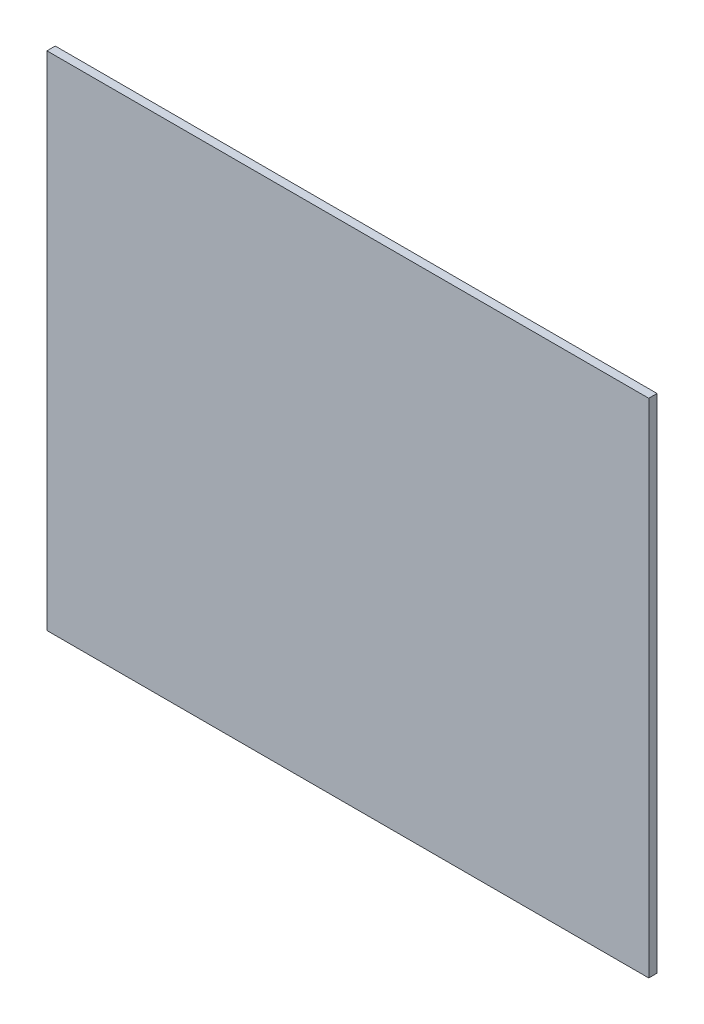
ISO-10303-21;
HEADER;
FILE_DESCRIPTION(('STEP AP214'),'2;1');
FILE_NAME('part.step','',(''),(''),'','','');
FILE_SCHEMA(('AUTOMOTIVE_DESIGN { 1 0 10303 214 1 1 1 1 }'));
ENDSEC;
DATA;
#1=APPLICATION_CONTEXT('core data for automotive mechanical design processes');
#2=APPLICATION_PROTOCOL_DEFINITION('international standard','automotive_design',2000,#1);
#3=PRODUCT_CONTEXT('',#1,'mechanical');
#4=PRODUCT('Part','Part','',(#3));
#5=PRODUCT_RELATED_PRODUCT_CATEGORY('part','',(#4));
#6=PRODUCT_DEFINITION_FORMATION('','',#4);
#7=PRODUCT_DEFINITION_CONTEXT('part definition',#1,'design');
#8=PRODUCT_DEFINITION('design','',#6,#7);
#9=PRODUCT_DEFINITION_SHAPE('','',#8);
#10=(LENGTH_UNIT() NAMED_UNIT(*) SI_UNIT(.MILLI.,.METRE.));
#11=(NAMED_UNIT(*) PLANE_ANGLE_UNIT() SI_UNIT($,.RADIAN.));
#12=(NAMED_UNIT(*) SI_UNIT($,.STERADIAN.) SOLID_ANGLE_UNIT());
#13=UNCERTAINTY_MEASURE_WITH_UNIT(LENGTH_MEASURE(1.E-05),#10,'distance_accuracy_value','');
#14=(GEOMETRIC_REPRESENTATION_CONTEXT(3) GLOBAL_UNCERTAINTY_ASSIGNED_CONTEXT((#13)) GLOBAL_UNIT_ASSIGNED_CONTEXT((#10,
#11,#12)) REPRESENTATION_CONTEXT('',''));
#15=CARTESIAN_POINT('',(0.,0.,0.));
#16=DIRECTION('',(0.,0.,1.));
#17=DIRECTION('',(1.,0.,0.));
#18=AXIS2_PLACEMENT_3D('',#15,#16,#17);
#19=CARTESIAN_POINT('',(90.5,151.,0.));
#20=DIRECTION('',(1.,0.,0.));
#21=DIRECTION('',(0.,0.,-1.));
#22=AXIS2_PLACEMENT_3D('',#19,#20,#21);
#23=PLANE('',#22);
#24=DIRECTION('',(0.,0.,1.));
#25=VECTOR('',#24,1.);
#26=CARTESIAN_POINT('',(90.5,0.,0.));
#27=LINE('',#26,#25);
#28=CARTESIAN_POINT('',(90.5,0.,21.));
#29=VERTEX_POINT('',#28);
#30=CARTESIAN_POINT('',(90.5,0.,23.5));
#31=VERTEX_POINT('',#30);
#32=EDGE_CURVE('E102',#29,#31,#27,.T.);
#33=ORIENTED_EDGE('',*,*,#32,.F.);
#34=DIRECTION('',(0.,-1.,0.));
#35=VECTOR('',#34,1.);
#36=CARTESIAN_POINT('',(90.5,151.,21.));
#37=LINE('',#36,#35);
#38=CARTESIAN_POINT('',(90.5,151.,21.));
#39=VERTEX_POINT('',#38);
#40=EDGE_CURVE('E11',#39,#29,#37,.T.);
#41=ORIENTED_EDGE('',*,*,#40,.F.);
#42=DIRECTION('',(0.,0.,1.));
#43=VECTOR('',#42,1.);
#44=CARTESIAN_POINT('',(90.5,151.,0.));
#45=LINE('',#44,#43);
#46=CARTESIAN_POINT('',(90.5,151.,23.5));
#47=VERTEX_POINT('',#46);
#48=EDGE_CURVE('E96',#39,#47,#45,.T.);
#49=ORIENTED_EDGE('',*,*,#48,.T.);
#50=DIRECTION('',(0.,-1.,0.));
#51=VECTOR('',#50,1.);
#52=CARTESIAN_POINT('',(90.5,151.,23.5));
#53=LINE('',#52,#51);
#54=EDGE_CURVE('E77',#47,#31,#53,.T.);
#55=ORIENTED_EDGE('',*,*,#54,.T.);
#56=EDGE_LOOP('',(#33,#41,#49,#55));
#57=FACE_BOUND('',#56,.T.);
#58=ADVANCED_FACE('F39',(#57),#23,.T.);
#59=CARTESIAN_POINT('',(0.,151.,21.));
#60=DIRECTION('',(0.,0.,-1.));
#61=DIRECTION('',(-1.,0.,0.));
#62=AXIS2_PLACEMENT_3D('',#59,#60,#61);
#63=PLANE('',#62);
#64=DIRECTION('',(1.,0.,0.));
#65=VECTOR('',#64,1.);
#66=CARTESIAN_POINT('',(0.,0.,21.));
#67=LINE('',#66,#65);
#68=CARTESIAN_POINT('',(-90.5,0.,21.));
#69=VERTEX_POINT('',#68);
#70=EDGE_CURVE('E90',#69,#29,#67,.T.);
#71=ORIENTED_EDGE('',*,*,#70,.F.);
#72=DIRECTION('',(0.,-1.,0.));
#73=VECTOR('',#72,1.);
#74=CARTESIAN_POINT('',(-90.5,151.,21.));
#75=LINE('',#74,#73);
#76=CARTESIAN_POINT('',(-90.5,151.,21.));
#77=VERTEX_POINT('',#76);
#78=EDGE_CURVE('E47',#77,#69,#75,.T.);
#79=ORIENTED_EDGE('',*,*,#78,.F.);
#80=DIRECTION('',(1.,0.,0.));
#81=VECTOR('',#80,1.);
#82=CARTESIAN_POINT('',(0.,151.,21.));
#83=LINE('',#82,#81);
#84=EDGE_CURVE('E88',#77,#39,#83,.T.);
#85=ORIENTED_EDGE('',*,*,#84,.T.);
#86=ORIENTED_EDGE('',*,*,#40,.T.);
#87=EDGE_LOOP('',(#71,#79,#85,#86));
#88=FACE_BOUND('',#87,.T.);
#89=ADVANCED_FACE('F86',(#88),#63,.T.);
#90=CARTESIAN_POINT('',(-90.5,151.,0.));
#91=DIRECTION('',(1.,0.,0.));
#92=DIRECTION('',(0.,0.,-1.));
#93=AXIS2_PLACEMENT_3D('',#90,#91,#92);
#94=PLANE('',#93);
#95=DIRECTION('',(0.,0.,1.));
#96=VECTOR('',#95,1.);
#97=CARTESIAN_POINT('',(-90.5,0.,0.));
#98=LINE('',#97,#96);
#99=CARTESIAN_POINT('',(-90.5,0.,23.5));
#100=VERTEX_POINT('',#99);
#101=EDGE_CURVE('E70',#69,#100,#98,.T.);
#102=ORIENTED_EDGE('',*,*,#101,.T.);
#103=DIRECTION('',(0.,-1.,0.));
#104=VECTOR('',#103,1.);
#105=CARTESIAN_POINT('',(-90.5,151.,23.5));
#106=LINE('',#105,#104);
#107=CARTESIAN_POINT('',(-90.5,151.,23.5));
#108=VERTEX_POINT('',#107);
#109=EDGE_CURVE('E91',#108,#100,#106,.T.);
#110=ORIENTED_EDGE('',*,*,#109,.F.);
#111=DIRECTION('',(0.,0.,1.));
#112=VECTOR('',#111,1.);
#113=CARTESIAN_POINT('',(-90.5,151.,0.));
#114=LINE('',#113,#112);
#115=EDGE_CURVE('E92',#77,#108,#114,.T.);
#116=ORIENTED_EDGE('',*,*,#115,.F.);
#117=ORIENTED_EDGE('',*,*,#78,.T.);
#118=EDGE_LOOP('',(#102,#110,#116,#117));
#119=FACE_BOUND('',#118,.T.);
#120=ADVANCED_FACE('F93',(#119),#94,.F.);
#121=CARTESIAN_POINT('',(0.,151.,23.5));
#122=DIRECTION('',(0.,0.,-1.));
#123=DIRECTION('',(-1.,0.,0.));
#124=AXIS2_PLACEMENT_3D('',#121,#122,#123);
#125=PLANE('',#124);
#126=DIRECTION('',(1.,0.,0.));
#127=VECTOR('',#126,1.);
#128=CARTESIAN_POINT('',(0.,0.,23.5));
#129=LINE('',#128,#127);
#130=EDGE_CURVE('E98',#100,#31,#129,.T.);
#131=ORIENTED_EDGE('',*,*,#130,.T.);
#132=ORIENTED_EDGE('',*,*,#54,.F.);
#133=DIRECTION('',(1.,0.,0.));
#134=VECTOR('',#133,1.);
#135=CARTESIAN_POINT('',(0.,151.,23.5));
#136=LINE('',#135,#134);
#137=EDGE_CURVE('E55',#108,#47,#136,.T.);
#138=ORIENTED_EDGE('',*,*,#137,.F.);
#139=ORIENTED_EDGE('',*,*,#109,.T.);
#140=EDGE_LOOP('',(#131,#132,#138,#139));
#141=FACE_BOUND('',#140,.T.);
#142=ADVANCED_FACE('F111',(#141),#125,.F.);
#143=CARTESIAN_POINT('',(0.,151.,0.));
#144=DIRECTION('',(0.,1.,0.));
#145=DIRECTION('',(0.,0.,1.));
#146=AXIS2_PLACEMENT_3D('',#143,#144,#145);
#147=PLANE('',#146);
#148=ORIENTED_EDGE('',*,*,#48,.F.);
#149=ORIENTED_EDGE('',*,*,#84,.F.);
#150=ORIENTED_EDGE('',*,*,#115,.T.);
#151=ORIENTED_EDGE('',*,*,#137,.T.);
#152=EDGE_LOOP('',(#148,#149,#150,#151));
#153=FACE_BOUND('',#152,.T.);
#154=ADVANCED_FACE('F95',(#153),#147,.T.);
#155=CARTESIAN_POINT('',(0.,0.,0.));
#156=DIRECTION('',(0.,1.,0.));
#157=DIRECTION('',(0.,0.,1.));
#158=AXIS2_PLACEMENT_3D('',#155,#156,#157);
#159=PLANE('',#158);
#160=ORIENTED_EDGE('',*,*,#32,.T.);
#161=ORIENTED_EDGE('',*,*,#130,.F.);
#162=ORIENTED_EDGE('',*,*,#101,.F.);
#163=ORIENTED_EDGE('',*,*,#70,.T.);
#164=EDGE_LOOP('',(#160,#161,#162,#163));
#165=FACE_BOUND('',#164,.T.);
#166=ADVANCED_FACE('F113',(#165),#159,.F.);
#167=CLOSED_SHELL('',(#58,#89,#120,#142,#154,#166));
#168=MANIFOLD_SOLID_BREP('B2',#167);
#169=ADVANCED_BREP_SHAPE_REPRESENTATION('',(#18,#168),#14);
#170=SHAPE_DEFINITION_REPRESENTATION(#9,#169);
ENDSEC;
END-ISO-10303-21;
